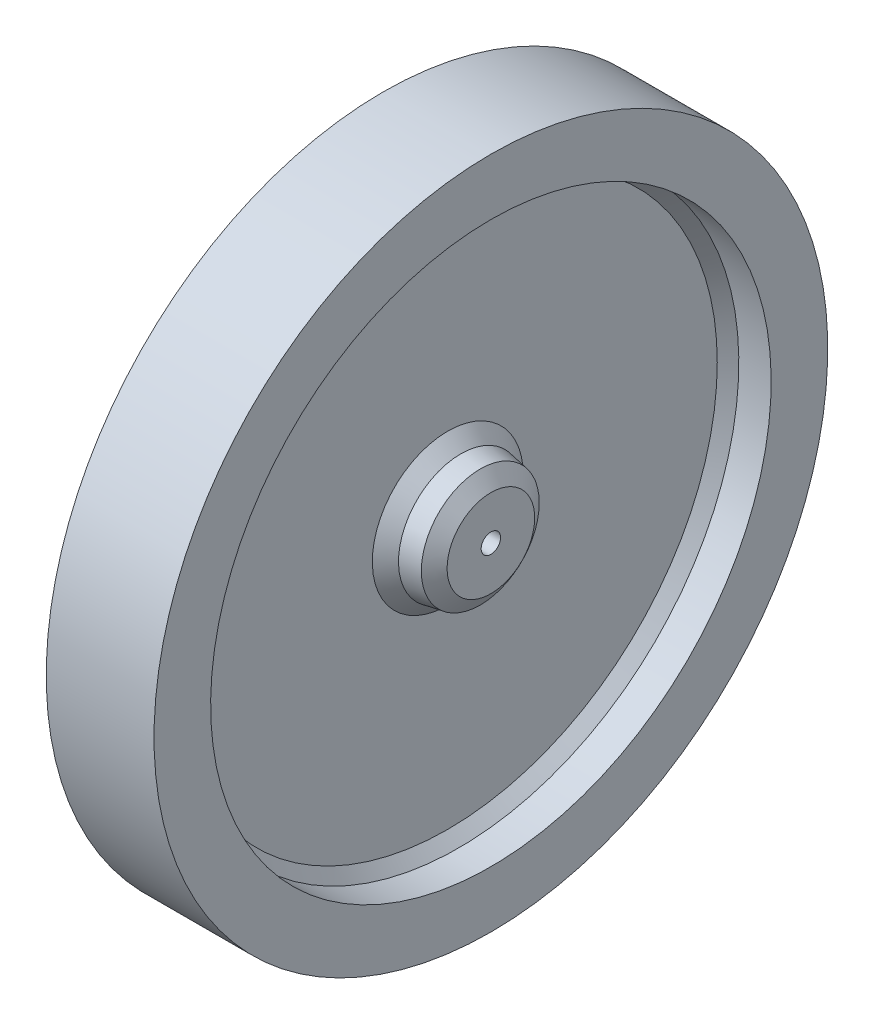
ISO-10303-21;
HEADER;
FILE_DESCRIPTION(('STEP AP214'),'2;1');
FILE_NAME('part.step','',(''),(''),'','','');
FILE_SCHEMA(('AUTOMOTIVE_DESIGN { 1 0 10303 214 1 1 1 1 }'));
ENDSEC;
DATA;
#1=APPLICATION_CONTEXT('core data for automotive mechanical design processes');
#2=APPLICATION_PROTOCOL_DEFINITION('international standard','automotive_design',2000,#1);
#3=PRODUCT_CONTEXT('',#1,'mechanical');
#4=PRODUCT('Part','Part','',(#3));
#5=PRODUCT_RELATED_PRODUCT_CATEGORY('part','',(#4));
#6=PRODUCT_DEFINITION_FORMATION('','',#4);
#7=PRODUCT_DEFINITION_CONTEXT('part definition',#1,'design');
#8=PRODUCT_DEFINITION('design','',#6,#7);
#9=PRODUCT_DEFINITION_SHAPE('','',#8);
#10=(LENGTH_UNIT() NAMED_UNIT(*) SI_UNIT(.MILLI.,.METRE.));
#11=(NAMED_UNIT(*) PLANE_ANGLE_UNIT() SI_UNIT($,.RADIAN.));
#12=(NAMED_UNIT(*) SI_UNIT($,.STERADIAN.) SOLID_ANGLE_UNIT());
#13=UNCERTAINTY_MEASURE_WITH_UNIT(LENGTH_MEASURE(1.E-05),#10,'distance_accuracy_value','');
#14=(GEOMETRIC_REPRESENTATION_CONTEXT(3) GLOBAL_UNCERTAINTY_ASSIGNED_CONTEXT((#13)) GLOBAL_UNIT_ASSIGNED_CONTEXT((#10,
#11,#12)) REPRESENTATION_CONTEXT('',''));
#15=CARTESIAN_POINT('',(0.,0.,0.));
#16=DIRECTION('',(0.,0.,1.));
#17=DIRECTION('',(1.,0.,0.));
#18=AXIS2_PLACEMENT_3D('',#15,#16,#17);
#19=CARTESIAN_POINT('',(-5.,0.,0.));
#20=DIRECTION('',(-1.,0.,0.));
#21=DIRECTION('',(0.,-1.,0.));
#22=AXIS2_PLACEMENT_3D('',#19,#20,#21);
#23=PLANE('',#22);
#24=CARTESIAN_POINT('',(-5.,0.,0.));
#25=DIRECTION('',(-1.,0.,0.));
#26=DIRECTION('',(0.,-1.,0.));
#27=AXIS2_PLACEMENT_3D('',#24,#25,#26);
#28=CIRCLE('',#27,26.);
#29=CARTESIAN_POINT('',(-5.,-26.,0.));
#30=VERTEX_POINT('',#29);
#31=EDGE_CURVE('E87',#30,#30,#28,.T.);
#32=ORIENTED_EDGE('',*,*,#31,.F.);
#33=EDGE_LOOP('',(#32));
#34=FACE_BOUND('',#33,.T.);
#35=CARTESIAN_POINT('',(-5.,0.,0.));
#36=DIRECTION('',(-1.,0.,0.));
#37=DIRECTION('',(0.,-1.,0.));
#38=AXIS2_PLACEMENT_3D('',#35,#36,#37);
#39=CIRCLE('',#38,31.25);
#40=CARTESIAN_POINT('',(-5.,-31.25,0.));
#41=VERTEX_POINT('',#40);
#42=EDGE_CURVE('E78',#41,#41,#39,.T.);
#43=ORIENTED_EDGE('',*,*,#42,.T.);
#44=EDGE_LOOP('',(#43));
#45=FACE_BOUND('',#44,.T.);
#46=ADVANCED_FACE('F34',(#34,#45),#23,.T.);
#47=CARTESIAN_POINT('',(-5.,0.,0.));
#48=DIRECTION('',(-1.,0.,0.));
#49=DIRECTION('',(0.,-1.,0.));
#50=AXIS2_PLACEMENT_3D('',#47,#48,#49);
#51=CYLINDRICAL_SURFACE('',#50,31.25);
#52=CARTESIAN_POINT('',(5.,0.,0.));
#53=DIRECTION('',(-1.,0.,0.));
#54=DIRECTION('',(0.,-1.,0.));
#55=AXIS2_PLACEMENT_3D('',#52,#53,#54);
#56=CIRCLE('',#55,31.25);
#57=CARTESIAN_POINT('',(5.00000000000001,-31.25,0.));
#58=VERTEX_POINT('',#57);
#59=EDGE_CURVE('E81',#58,#58,#56,.T.);
#60=ORIENTED_EDGE('',*,*,#59,.T.);
#61=EDGE_LOOP('',(#60));
#62=FACE_BOUND('',#61,.T.);
#63=ORIENTED_EDGE('',*,*,#42,.F.);
#64=EDGE_LOOP('',(#63));
#65=FACE_BOUND('',#64,.T.);
#66=ADVANCED_FACE('F127',(#62,#65),#51,.T.);
#67=CARTESIAN_POINT('',(5.00000000000001,-31.25,0.));
#68=DIRECTION('',(1.,0.,0.));
#69=DIRECTION('',(0.,1.,0.));
#70=AXIS2_PLACEMENT_3D('',#67,#68,#69);
#71=PLANE('',#70);
#72=CARTESIAN_POINT('',(5.,0.,0.));
#73=DIRECTION('',(1.,0.,0.));
#74=DIRECTION('',(0.,1.,0.));
#75=AXIS2_PLACEMENT_3D('',#72,#73,#74);
#76=CIRCLE('',#75,26.);
#77=CARTESIAN_POINT('',(5.,26.,0.));
#78=VERTEX_POINT('',#77);
#79=EDGE_CURVE('E84',#78,#78,#76,.T.);
#80=ORIENTED_EDGE('',*,*,#79,.F.);
#81=EDGE_LOOP('',(#80));
#82=FACE_BOUND('',#81,.T.);
#83=ORIENTED_EDGE('',*,*,#59,.F.);
#84=EDGE_LOOP('',(#83));
#85=FACE_BOUND('',#84,.T.);
#86=ADVANCED_FACE('F133',(#82,#85),#71,.T.);
#87=CARTESIAN_POINT('',(1.,0.,0.));
#88=DIRECTION('',(1.,0.,0.));
#89=DIRECTION('',(0.,1.,0.));
#90=AXIS2_PLACEMENT_3D('',#87,#88,#89);
#91=CYLINDRICAL_SURFACE('',#90,26.);
#92=CARTESIAN_POINT('',(1.99999999999997,0.,0.));
#93=DIRECTION('',(1.,0.,0.));
#94=DIRECTION('',(0.,1.,0.));
#95=AXIS2_PLACEMENT_3D('',#92,#93,#94);
#96=CIRCLE('',#95,26.);
#97=CARTESIAN_POINT('',(1.99999999999997,26.,0.));
#98=VERTEX_POINT('',#97);
#99=EDGE_CURVE('E69',#98,#98,#96,.F.);
#100=ORIENTED_EDGE('',*,*,#99,.T.);
#101=EDGE_LOOP('',(#100));
#102=FACE_BOUND('',#101,.T.);
#103=ORIENTED_EDGE('',*,*,#79,.T.);
#104=EDGE_LOOP('',(#103));
#105=FACE_BOUND('',#104,.T.);
#106=ADVANCED_FACE('F172',(#102,#105),#91,.F.);
#107=CARTESIAN_POINT('',(1.,0.,0.));
#108=DIRECTION('',(1.,0.,0.));
#109=DIRECTION('',(0.,1.,0.));
#110=AXIS2_PLACEMENT_3D('',#107,#108,#109);
#111=PLANE('',#110);
#112=CARTESIAN_POINT('',(1.,0.,0.));
#113=DIRECTION('',(1.,0.,0.));
#114=DIRECTION('',(0.,1.,0.));
#115=AXIS2_PLACEMENT_3D('',#112,#113,#114);
#116=CIRCLE('',#115,25.);
#117=CARTESIAN_POINT('',(0.999999999999996,25.,0.));
#118=VERTEX_POINT('',#117);
#119=EDGE_CURVE('E72',#118,#118,#116,.T.);
#120=ORIENTED_EDGE('',*,*,#119,.T.);
#121=EDGE_LOOP('',(#120));
#122=FACE_BOUND('',#121,.T.);
#123=CARTESIAN_POINT('',(1.,0.,0.));
#124=DIRECTION('',(1.,0.,0.));
#125=DIRECTION('',(0.,1.,0.));
#126=AXIS2_PLACEMENT_3D('',#123,#124,#125);
#127=CIRCLE('',#126,7.);
#128=CARTESIAN_POINT('',(1.,7.,0.));
#129=VERTEX_POINT('',#128);
#130=EDGE_CURVE('E75',#129,#129,#127,.F.);
#131=ORIENTED_EDGE('',*,*,#130,.T.);
#132=EDGE_LOOP('',(#131));
#133=FACE_BOUND('',#132,.T.);
#134=ADVANCED_FACE('F165',(#122,#133),#111,.T.);
#135=CARTESIAN_POINT('',(1.,0.,0.));
#136=DIRECTION('',(-1.,0.,0.));
#137=DIRECTION('',(0.,1.,0.));
#138=AXIS2_PLACEMENT_3D('',#135,#136,#137);
#139=CONICAL_SURFACE('',#138,6.,0.174532925199433);
#140=CARTESIAN_POINT('',(2.21407400337106,0.,0.));
#141=DIRECTION('',(1.,0.,0.));
#142=DIRECTION('',(0.,1.,0.));
#143=AXIS2_PLACEMENT_3D('',#140,#141,#142);
#144=CIRCLE('',#143,5.78592599662894);
#145=CARTESIAN_POINT('',(2.21407400337106,5.78592599662894,0.));
#146=VERTEX_POINT('',#145);
#147=EDGE_CURVE('E63',#146,#146,#144,.T.);
#148=ORIENTED_EDGE('',*,*,#147,.T.);
#149=EDGE_LOOP('',(#148));
#150=FACE_BOUND('',#149,.T.);
#151=CARTESIAN_POINT('',(4.01519224698777,0.,0.));
#152=DIRECTION('',(-1.,0.,0.));
#153=DIRECTION('',(0.,-1.,0.));
#154=AXIS2_PLACEMENT_3D('',#151,#152,#153);
#155=CIRCLE('',#154,5.46834025483308);
#156=CARTESIAN_POINT('',(4.01519224698777,-5.46834025483308,0.));
#157=VERTEX_POINT('',#156);
#158=EDGE_CURVE('E66',#157,#157,#155,.T.);
#159=ORIENTED_EDGE('',*,*,#158,.T.);
#160=EDGE_LOOP('',(#159));
#161=FACE_BOUND('',#160,.T.);
#162=ADVANCED_FACE('F156',(#150,#161),#139,.T.);
#163=CARTESIAN_POINT('',(5.,0.,0.));
#164=DIRECTION('',(1.,0.,0.));
#165=DIRECTION('',(0.,1.,0.));
#166=AXIS2_PLACEMENT_3D('',#163,#164,#165);
#167=PLANE('',#166);
#168=CARTESIAN_POINT('',(5.00000000000002,0.,0.));
#169=DIRECTION('',(-1.,0.,0.));
#170=DIRECTION('',(0.,-1.,0.));
#171=AXIS2_PLACEMENT_3D('',#168,#169,#170);
#172=CIRCLE('',#171,0.9);
#173=CARTESIAN_POINT('',(5.00000000000002,-0.899999999999999,0.));
#174=VERTEX_POINT('',#173);
#175=EDGE_CURVE('E90',#174,#174,#172,.T.);
#176=ORIENTED_EDGE('',*,*,#175,.T.);
#177=EDGE_LOOP('',(#176));
#178=FACE_BOUND('',#177,.T.);
#179=CARTESIAN_POINT('',(5.,0.,0.));
#180=DIRECTION('',(1.,0.,0.));
#181=DIRECTION('',(0.,1.,0.));
#182=AXIS2_PLACEMENT_3D('',#179,#180,#181);
#183=CIRCLE('',#182,4.06188902534449);
#184=CARTESIAN_POINT('',(5.,4.06188902534449,0.));
#185=VERTEX_POINT('',#184);
#186=EDGE_CURVE('E60',#185,#185,#183,.T.);
#187=ORIENTED_EDGE('',*,*,#186,.T.);
#188=EDGE_LOOP('',(#187));
#189=FACE_BOUND('',#188,.T.);
#190=ADVANCED_FACE('F97',(#178,#189),#167,.T.);
#191=CARTESIAN_POINT('',(-1.,0.,0.));
#192=DIRECTION('',(-1.,0.,0.));
#193=DIRECTION('',(0.,-1.,0.));
#194=AXIS2_PLACEMENT_3D('',#191,#192,#193);
#195=CYLINDRICAL_SURFACE('',#194,26.);
#196=CARTESIAN_POINT('',(-1.99999999999997,0.,0.));
#197=DIRECTION('',(-1.,0.,0.));
#198=DIRECTION('',(0.,-1.,0.));
#199=AXIS2_PLACEMENT_3D('',#196,#197,#198);
#200=CIRCLE('',#199,26.);
#201=CARTESIAN_POINT('',(-1.99999999999997,-26.,0.));
#202=VERTEX_POINT('',#201);
#203=EDGE_CURVE('E49',#202,#202,#200,.F.);
#204=ORIENTED_EDGE('',*,*,#203,.T.);
#205=EDGE_LOOP('',(#204));
#206=FACE_BOUND('',#205,.T.);
#207=ORIENTED_EDGE('',*,*,#31,.T.);
#208=EDGE_LOOP('',(#207));
#209=FACE_BOUND('',#208,.T.);
#210=ADVANCED_FACE('F155',(#206,#209),#195,.F.);
#211=CARTESIAN_POINT('',(-1.,0.,0.));
#212=DIRECTION('',(-1.,0.,0.));
#213=DIRECTION('',(0.,-1.,0.));
#214=AXIS2_PLACEMENT_3D('',#211,#212,#213);
#215=PLANE('',#214);
#216=CARTESIAN_POINT('',(-1.,0.,0.));
#217=DIRECTION('',(-1.,0.,0.));
#218=DIRECTION('',(0.,-1.,0.));
#219=AXIS2_PLACEMENT_3D('',#216,#217,#218);
#220=CIRCLE('',#219,25.);
#221=CARTESIAN_POINT('',(-0.999999999999996,-25.,0.));
#222=VERTEX_POINT('',#221);
#223=EDGE_CURVE('E54',#222,#222,#220,.T.);
#224=ORIENTED_EDGE('',*,*,#223,.T.);
#225=EDGE_LOOP('',(#224));
#226=FACE_BOUND('',#225,.T.);
#227=CARTESIAN_POINT('',(-1.,0.,0.));
#228=DIRECTION('',(-1.,0.,0.));
#229=DIRECTION('',(0.,-1.,0.));
#230=AXIS2_PLACEMENT_3D('',#227,#228,#229);
#231=CIRCLE('',#230,7.);
#232=CARTESIAN_POINT('',(-1.,-7.,0.));
#233=VERTEX_POINT('',#232);
#234=EDGE_CURVE('E57',#233,#233,#231,.F.);
#235=ORIENTED_EDGE('',*,*,#234,.T.);
#236=EDGE_LOOP('',(#235));
#237=FACE_BOUND('',#236,.T.);
#238=ADVANCED_FACE('F162',(#226,#237),#215,.T.);
#239=CARTESIAN_POINT('',(-1.,0.,0.));
#240=DIRECTION('',(1.,0.,0.));
#241=DIRECTION('',(0.,-1.,0.));
#242=AXIS2_PLACEMENT_3D('',#239,#240,#241);
#243=CONICAL_SURFACE('',#242,6.,0.174532925199433);
#244=CARTESIAN_POINT('',(-4.01519224698777,0.,0.));
#245=DIRECTION('',(1.,0.,0.));
#246=DIRECTION('',(0.,1.,0.));
#247=AXIS2_PLACEMENT_3D('',#244,#245,#246);
#248=CIRCLE('',#247,5.46834025483308);
#249=CARTESIAN_POINT('',(-4.01519224698777,5.46834025483308,0.));
#250=VERTEX_POINT('',#249);
#251=EDGE_CURVE('E10',#250,#250,#248,.T.);
#252=ORIENTED_EDGE('',*,*,#251,.T.);
#253=EDGE_LOOP('',(#252));
#254=FACE_BOUND('',#253,.T.);
#255=CARTESIAN_POINT('',(-2.21407400337106,0.,0.));
#256=DIRECTION('',(-1.,0.,0.));
#257=DIRECTION('',(0.,-1.,0.));
#258=AXIS2_PLACEMENT_3D('',#255,#256,#257);
#259=CIRCLE('',#258,5.78592599662894);
#260=CARTESIAN_POINT('',(-2.21407400337106,-5.78592599662894,0.));
#261=VERTEX_POINT('',#260);
#262=EDGE_CURVE('E41',#261,#261,#259,.T.);
#263=ORIENTED_EDGE('',*,*,#262,.T.);
#264=EDGE_LOOP('',(#263));
#265=FACE_BOUND('',#264,.T.);
#266=ADVANCED_FACE('F110',(#254,#265),#243,.T.);
#267=CARTESIAN_POINT('',(-5.,0.,0.));
#268=DIRECTION('',(-1.,0.,0.));
#269=DIRECTION('',(0.,-1.,0.));
#270=AXIS2_PLACEMENT_3D('',#267,#268,#269);
#271=PLANE('',#270);
#272=CARTESIAN_POINT('',(-5.,0.,0.));
#273=DIRECTION('',(-1.,0.,0.));
#274=DIRECTION('',(0.,-1.,0.));
#275=AXIS2_PLACEMENT_3D('',#272,#273,#274);
#276=CIRCLE('',#275,0.9);
#277=CARTESIAN_POINT('',(-5.,-0.900000000000001,0.));
#278=VERTEX_POINT('',#277);
#279=EDGE_CURVE('E91',#278,#278,#276,.T.);
#280=ORIENTED_EDGE('',*,*,#279,.F.);
#281=EDGE_LOOP('',(#280));
#282=FACE_BOUND('',#281,.T.);
#283=CARTESIAN_POINT('',(-5.,0.,0.));
#284=DIRECTION('',(-1.,0.,0.));
#285=DIRECTION('',(0.,-1.,0.));
#286=AXIS2_PLACEMENT_3D('',#283,#284,#285);
#287=CIRCLE('',#286,4.06188902534449);
#288=CARTESIAN_POINT('',(-5.,-4.06188902534449,0.));
#289=VERTEX_POINT('',#288);
#290=EDGE_CURVE('E45',#289,#289,#287,.T.);
#291=ORIENTED_EDGE('',*,*,#290,.T.);
#292=EDGE_LOOP('',(#291));
#293=FACE_BOUND('',#292,.T.);
#294=ADVANCED_FACE('F106',(#282,#293),#271,.T.);
#295=CARTESIAN_POINT('',(1.,0.,0.));
#296=DIRECTION('',(1.,0.,0.));
#297=DIRECTION('',(0.,1.,0.));
#298=AXIS2_PLACEMENT_3D('',#295,#296,#297);
#299=CONICAL_SURFACE('',#298,25.,0.78539816339745);
#300=ORIENTED_EDGE('',*,*,#99,.F.);
#301=EDGE_LOOP('',(#300));
#302=FACE_BOUND('',#301,.T.);
#303=ORIENTED_EDGE('',*,*,#119,.F.);
#304=EDGE_LOOP('',(#303));
#305=FACE_BOUND('',#304,.T.);
#306=ADVANCED_FACE('F109',(#302,#305),#299,.F.);
#307=CARTESIAN_POINT('',(2.21407400337106,0.,0.));
#308=DIRECTION('',(-1.,0.,0.));
#309=DIRECTION('',(0.,-1.,0.));
#310=AXIS2_PLACEMENT_3D('',#307,#308,#309);
#311=CONICAL_SURFACE('',#310,5.78592599662894,0.785398163397446);
#312=ORIENTED_EDGE('',*,*,#130,.F.);
#313=EDGE_LOOP('',(#312));
#314=FACE_BOUND('',#313,.T.);
#315=ORIENTED_EDGE('',*,*,#147,.F.);
#316=EDGE_LOOP('',(#315));
#317=FACE_BOUND('',#316,.T.);
#318=ADVANCED_FACE('F142',(#314,#317),#311,.T.);
#319=CARTESIAN_POINT('',(5.,0.,0.));
#320=DIRECTION('',(-1.,0.,0.));
#321=DIRECTION('',(0.,-1.,0.));
#322=AXIS2_PLACEMENT_3D('',#319,#320,#321);
#323=CONICAL_SURFACE('',#322,4.06188902534449,0.959931088596879);
#324=ORIENTED_EDGE('',*,*,#158,.F.);
#325=EDGE_LOOP('',(#324));
#326=FACE_BOUND('',#325,.T.);
#327=ORIENTED_EDGE('',*,*,#186,.F.);
#328=EDGE_LOOP('',(#327));
#329=FACE_BOUND('',#328,.T.);
#330=ADVANCED_FACE('F123',(#326,#329),#323,.T.);
#331=CARTESIAN_POINT('',(-1.,0.,0.));
#332=DIRECTION('',(-1.,0.,0.));
#333=DIRECTION('',(0.,-1.,0.));
#334=AXIS2_PLACEMENT_3D('',#331,#332,#333);
#335=CONICAL_SURFACE('',#334,25.,0.78539816339745);
#336=ORIENTED_EDGE('',*,*,#203,.F.);
#337=EDGE_LOOP('',(#336));
#338=FACE_BOUND('',#337,.T.);
#339=ORIENTED_EDGE('',*,*,#223,.F.);
#340=EDGE_LOOP('',(#339));
#341=FACE_BOUND('',#340,.T.);
#342=ADVANCED_FACE('F116',(#338,#341),#335,.F.);
#343=CARTESIAN_POINT('',(-5.,0.,0.));
#344=DIRECTION('',(1.,0.,0.));
#345=DIRECTION('',(0.,1.,0.));
#346=AXIS2_PLACEMENT_3D('',#343,#344,#345);
#347=CONICAL_SURFACE('',#346,4.06188902534449,0.959931088596879);
#348=ORIENTED_EDGE('',*,*,#251,.F.);
#349=EDGE_LOOP('',(#348));
#350=FACE_BOUND('',#349,.T.);
#351=ORIENTED_EDGE('',*,*,#290,.F.);
#352=EDGE_LOOP('',(#351));
#353=FACE_BOUND('',#352,.T.);
#354=ADVANCED_FACE('F114',(#350,#353),#347,.T.);
#355=CARTESIAN_POINT('',(-2.21407400337106,0.,0.));
#356=DIRECTION('',(1.,0.,0.));
#357=DIRECTION('',(0.,1.,0.));
#358=AXIS2_PLACEMENT_3D('',#355,#356,#357);
#359=CONICAL_SURFACE('',#358,5.78592599662894,0.785398163397446);
#360=ORIENTED_EDGE('',*,*,#234,.F.);
#361=EDGE_LOOP('',(#360));
#362=FACE_BOUND('',#361,.T.);
#363=ORIENTED_EDGE('',*,*,#262,.F.);
#364=EDGE_LOOP('',(#363));
#365=FACE_BOUND('',#364,.T.);
#366=ADVANCED_FACE('F36',(#362,#365),#359,.T.);
#367=CARTESIAN_POINT('',(5.00000000000002,0.,0.));
#368=DIRECTION('',(-1.,0.,0.));
#369=DIRECTION('',(0.,-1.,0.));
#370=AXIS2_PLACEMENT_3D('',#367,#368,#369);
#371=CYLINDRICAL_SURFACE('',#370,0.9);
#372=ORIENTED_EDGE('',*,*,#175,.F.);
#373=EDGE_LOOP('',(#372));
#374=FACE_BOUND('',#373,.T.);
#375=ORIENTED_EDGE('',*,*,#279,.T.);
#376=EDGE_LOOP('',(#375));
#377=FACE_BOUND('',#376,.T.);
#378=ADVANCED_FACE('F100',(#374,#377),#371,.F.);
#379=CLOSED_SHELL('',(#46,#66,#86,#106,#134,#162,#190,#210,#238,#266,#294,#306,#318,#330,#342,
#354,#366,#378));
#380=MANIFOLD_SOLID_BREP('B2',#379);
#381=ADVANCED_BREP_SHAPE_REPRESENTATION('',(#18,#380),#14);
#382=SHAPE_DEFINITION_REPRESENTATION(#9,#381);
ENDSEC;
END-ISO-10303-21;
